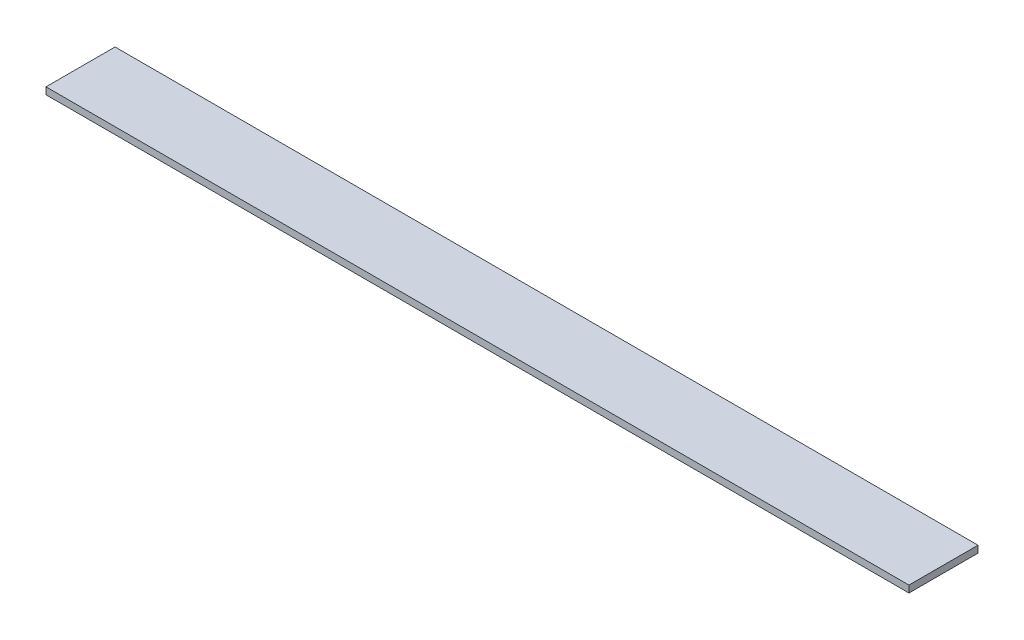
ISO-10303-21;
HEADER;
FILE_DESCRIPTION(('STEP AP214'),'2;1');
FILE_NAME('part.step','',(''),(''),'','','');
FILE_SCHEMA(('AUTOMOTIVE_DESIGN { 1 0 10303 214 1 1 1 1 }'));
ENDSEC;
DATA;
#1=APPLICATION_CONTEXT('core data for automotive mechanical design processes');
#2=APPLICATION_PROTOCOL_DEFINITION('international standard','automotive_design',2000,#1);
#3=PRODUCT_CONTEXT('',#1,'mechanical');
#4=PRODUCT('Part','Part','',(#3));
#5=PRODUCT_RELATED_PRODUCT_CATEGORY('part','',(#4));
#6=PRODUCT_DEFINITION_FORMATION('','',#4);
#7=PRODUCT_DEFINITION_CONTEXT('part definition',#1,'design');
#8=PRODUCT_DEFINITION('design','',#6,#7);
#9=PRODUCT_DEFINITION_SHAPE('','',#8);
#10=(LENGTH_UNIT() NAMED_UNIT(*) SI_UNIT(.MILLI.,.METRE.));
#11=(NAMED_UNIT(*) PLANE_ANGLE_UNIT() SI_UNIT($,.RADIAN.));
#12=(NAMED_UNIT(*) SI_UNIT($,.STERADIAN.) SOLID_ANGLE_UNIT());
#13=UNCERTAINTY_MEASURE_WITH_UNIT(LENGTH_MEASURE(1.E-05),#10,'distance_accuracy_value','');
#14=(GEOMETRIC_REPRESENTATION_CONTEXT(3) GLOBAL_UNCERTAINTY_ASSIGNED_CONTEXT((#13)) GLOBAL_UNIT_ASSIGNED_CONTEXT((#10,
#11,#12)) REPRESENTATION_CONTEXT('',''));
#15=CARTESIAN_POINT('',(0.,0.,0.));
#16=DIRECTION('',(0.,0.,1.));
#17=DIRECTION('',(1.,0.,0.));
#18=AXIS2_PLACEMENT_3D('',#15,#16,#17);
#19=CARTESIAN_POINT('',(-625.,10.,-50.));
#20=DIRECTION('',(1.,0.,0.));
#21=DIRECTION('',(0.,0.,-1.));
#22=AXIS2_PLACEMENT_3D('',#19,#20,#21);
#23=PLANE('',#22);
#24=DIRECTION('',(0.,0.,1.));
#25=VECTOR('',#24,1.);
#26=CARTESIAN_POINT('',(-625.,0.,-50.));
#27=LINE('',#26,#25);
#28=CARTESIAN_POINT('',(-625.,0.,-50.));
#29=VERTEX_POINT('',#28);
#30=CARTESIAN_POINT('',(-625.,0.,50.0000000000001));
#31=VERTEX_POINT('',#30);
#32=EDGE_CURVE('E97',#29,#31,#27,.T.);
#33=ORIENTED_EDGE('',*,*,#32,.T.);
#34=DIRECTION('',(0.,-1.,0.));
#35=VECTOR('',#34,1.);
#36=CARTESIAN_POINT('',(-625.,10.,50.0000000000001));
#37=LINE('',#36,#35);
#38=CARTESIAN_POINT('',(-625.,10.,50.0000000000001));
#39=VERTEX_POINT('',#38);
#40=EDGE_CURVE('E11',#39,#31,#37,.T.);
#41=ORIENTED_EDGE('',*,*,#40,.F.);
#42=DIRECTION('',(0.,0.,1.));
#43=VECTOR('',#42,1.);
#44=CARTESIAN_POINT('',(-625.,10.,-50.));
#45=LINE('',#44,#43);
#46=CARTESIAN_POINT('',(-625.,10.,-50.));
#47=VERTEX_POINT('',#46);
#48=EDGE_CURVE('E85',#47,#39,#45,.T.);
#49=ORIENTED_EDGE('',*,*,#48,.F.);
#50=DIRECTION('',(0.,-1.,0.));
#51=VECTOR('',#50,1.);
#52=CARTESIAN_POINT('',(-625.,10.,-50.));
#53=LINE('',#52,#51);
#54=EDGE_CURVE('E93',#47,#29,#53,.T.);
#55=ORIENTED_EDGE('',*,*,#54,.T.);
#56=EDGE_LOOP('',(#33,#41,#49,#55));
#57=FACE_BOUND('',#56,.T.);
#58=ADVANCED_FACE('F34',(#57),#23,.F.);
#59=CARTESIAN_POINT('',(-625.,10.,50.0000000000001));
#60=DIRECTION('',(0.,0.,-1.));
#61=DIRECTION('',(-1.,0.,0.));
#62=AXIS2_PLACEMENT_3D('',#59,#60,#61);
#63=PLANE('',#62);
#64=DIRECTION('',(1.,0.,0.));
#65=VECTOR('',#64,1.);
#66=CARTESIAN_POINT('',(-625.,0.,50.0000000000001));
#67=LINE('',#66,#65);
#68=CARTESIAN_POINT('',(625.,0.,50.));
#69=VERTEX_POINT('',#68);
#70=EDGE_CURVE('E89',#31,#69,#67,.T.);
#71=ORIENTED_EDGE('',*,*,#70,.T.);
#72=DIRECTION('',(0.,-1.,0.));
#73=VECTOR('',#72,1.);
#74=CARTESIAN_POINT('',(625.,10.,50.));
#75=LINE('',#74,#73);
#76=CARTESIAN_POINT('',(625.,10.,50.));
#77=VERTEX_POINT('',#76);
#78=EDGE_CURVE('E42',#77,#69,#75,.T.);
#79=ORIENTED_EDGE('',*,*,#78,.F.);
#80=DIRECTION('',(1.,0.,0.));
#81=VECTOR('',#80,1.);
#82=CARTESIAN_POINT('',(-625.,10.,50.0000000000001));
#83=LINE('',#82,#81);
#84=EDGE_CURVE('E80',#39,#77,#83,.T.);
#85=ORIENTED_EDGE('',*,*,#84,.F.);
#86=ORIENTED_EDGE('',*,*,#40,.T.);
#87=EDGE_LOOP('',(#71,#79,#85,#86));
#88=FACE_BOUND('',#87,.T.);
#89=ADVANCED_FACE('F88',(#88),#63,.F.);
#90=CARTESIAN_POINT('',(625.,10.,-50.));
#91=DIRECTION('',(-1.,0.,0.));
#92=DIRECTION('',(0.,0.,1.));
#93=AXIS2_PLACEMENT_3D('',#90,#91,#92);
#94=PLANE('',#93);
#95=DIRECTION('',(0.,0.,-1.));
#96=VECTOR('',#95,1.);
#97=CARTESIAN_POINT('',(625.,0.,-50.));
#98=LINE('',#97,#96);
#99=CARTESIAN_POINT('',(625.,0.,-50.));
#100=VERTEX_POINT('',#99);
#101=EDGE_CURVE('E67',#69,#100,#98,.T.);
#102=ORIENTED_EDGE('',*,*,#101,.T.);
#103=DIRECTION('',(0.,-1.,0.));
#104=VECTOR('',#103,1.);
#105=CARTESIAN_POINT('',(625.,10.,-50.));
#106=LINE('',#105,#104);
#107=CARTESIAN_POINT('',(625.,10.,-50.));
#108=VERTEX_POINT('',#107);
#109=EDGE_CURVE('E90',#108,#100,#106,.T.);
#110=ORIENTED_EDGE('',*,*,#109,.F.);
#111=DIRECTION('',(0.,0.,-1.));
#112=VECTOR('',#111,1.);
#113=CARTESIAN_POINT('',(625.,10.,-50.));
#114=LINE('',#113,#112);
#115=EDGE_CURVE('E83',#77,#108,#114,.T.);
#116=ORIENTED_EDGE('',*,*,#115,.F.);
#117=ORIENTED_EDGE('',*,*,#78,.T.);
#118=EDGE_LOOP('',(#102,#110,#116,#117));
#119=FACE_BOUND('',#118,.T.);
#120=ADVANCED_FACE('F91',(#119),#94,.F.);
#121=CARTESIAN_POINT('',(-625.,10.,-50.));
#122=DIRECTION('',(0.,0.,1.));
#123=DIRECTION('',(1.,0.,0.));
#124=AXIS2_PLACEMENT_3D('',#121,#122,#123);
#125=PLANE('',#124);
#126=DIRECTION('',(-1.,0.,0.));
#127=VECTOR('',#126,1.);
#128=CARTESIAN_POINT('',(-625.,0.,-50.));
#129=LINE('',#128,#127);
#130=EDGE_CURVE('E73',#100,#29,#129,.T.);
#131=ORIENTED_EDGE('',*,*,#130,.T.);
#132=ORIENTED_EDGE('',*,*,#54,.F.);
#133=DIRECTION('',(-1.,0.,0.));
#134=VECTOR('',#133,1.);
#135=CARTESIAN_POINT('',(-625.,10.,-50.));
#136=LINE('',#135,#134);
#137=EDGE_CURVE('E50',#108,#47,#136,.T.);
#138=ORIENTED_EDGE('',*,*,#137,.F.);
#139=ORIENTED_EDGE('',*,*,#109,.T.);
#140=EDGE_LOOP('',(#131,#132,#138,#139));
#141=FACE_BOUND('',#140,.T.);
#142=ADVANCED_FACE('F104',(#141),#125,.F.);
#143=CARTESIAN_POINT('',(0.,10.,0.));
#144=DIRECTION('',(0.,1.,0.));
#145=DIRECTION('',(0.,0.,1.));
#146=AXIS2_PLACEMENT_3D('',#143,#144,#145);
#147=PLANE('',#146);
#148=ORIENTED_EDGE('',*,*,#48,.T.);
#149=ORIENTED_EDGE('',*,*,#84,.T.);
#150=ORIENTED_EDGE('',*,*,#115,.T.);
#151=ORIENTED_EDGE('',*,*,#137,.T.);
#152=EDGE_LOOP('',(#148,#149,#150,#151));
#153=FACE_BOUND('',#152,.T.);
#154=ADVANCED_FACE('F81',(#153),#147,.T.);
#155=CARTESIAN_POINT('',(0.,0.,0.));
#156=DIRECTION('',(0.,1.,0.));
#157=DIRECTION('',(0.,0.,1.));
#158=AXIS2_PLACEMENT_3D('',#155,#156,#157);
#159=PLANE('',#158);
#160=ORIENTED_EDGE('',*,*,#32,.F.);
#161=ORIENTED_EDGE('',*,*,#130,.F.);
#162=ORIENTED_EDGE('',*,*,#101,.F.);
#163=ORIENTED_EDGE('',*,*,#70,.F.);
#164=EDGE_LOOP('',(#160,#161,#162,#163));
#165=FACE_BOUND('',#164,.T.);
#166=ADVANCED_FACE('F107',(#165),#159,.F.);
#167=CLOSED_SHELL('',(#58,#89,#120,#142,#154,#166));
#168=MANIFOLD_SOLID_BREP('B2',#167);
#169=ADVANCED_BREP_SHAPE_REPRESENTATION('',(#18,#168),#14);
#170=SHAPE_DEFINITION_REPRESENTATION(#9,#169);
ENDSEC;
END-ISO-10303-21;
